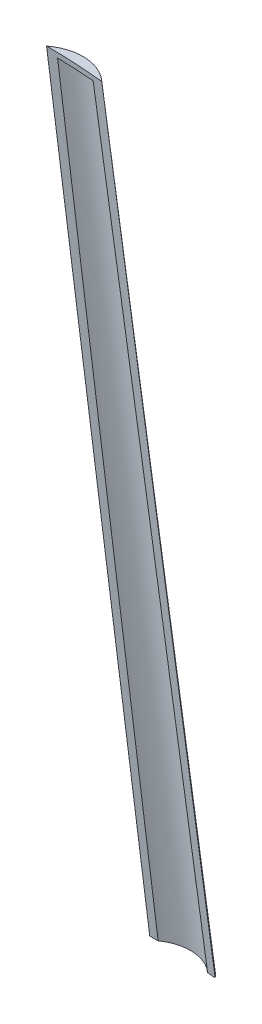
ISO-10303-21;
HEADER;
FILE_DESCRIPTION(('STEP AP214'),'2;1');
FILE_NAME('part.step','',(''),(''),'','','');
FILE_SCHEMA(('AUTOMOTIVE_DESIGN { 1 0 10303 214 1 1 1 1 }'));
ENDSEC;
DATA;
#1=APPLICATION_CONTEXT('core data for automotive mechanical design processes');
#2=APPLICATION_PROTOCOL_DEFINITION('international standard','automotive_design',2000,#1);
#3=PRODUCT_CONTEXT('',#1,'mechanical');
#4=PRODUCT('Part','Part','',(#3));
#5=PRODUCT_RELATED_PRODUCT_CATEGORY('part','',(#4));
#6=PRODUCT_DEFINITION_FORMATION('','',#4);
#7=PRODUCT_DEFINITION_CONTEXT('part definition',#1,'design');
#8=PRODUCT_DEFINITION('design','',#6,#7);
#9=PRODUCT_DEFINITION_SHAPE('','',#8);
#10=(LENGTH_UNIT() NAMED_UNIT(*) SI_UNIT(.MILLI.,.METRE.));
#11=(NAMED_UNIT(*) PLANE_ANGLE_UNIT() SI_UNIT($,.RADIAN.));
#12=(NAMED_UNIT(*) SI_UNIT($,.STERADIAN.) SOLID_ANGLE_UNIT());
#13=UNCERTAINTY_MEASURE_WITH_UNIT(LENGTH_MEASURE(1.E-05),#10,'distance_accuracy_value','');
#14=(GEOMETRIC_REPRESENTATION_CONTEXT(3) GLOBAL_UNCERTAINTY_ASSIGNED_CONTEXT((#13)) GLOBAL_UNIT_ASSIGNED_CONTEXT((#10,
#11,#12)) REPRESENTATION_CONTEXT('',''));
#15=CARTESIAN_POINT('',(0.,0.,0.));
#16=DIRECTION('',(0.,0.,1.));
#17=DIRECTION('',(1.,0.,0.));
#18=AXIS2_PLACEMENT_3D('',#15,#16,#17);
#19=CARTESIAN_POINT('',(0.76133051889543,0.,-14.5209674334158));
#20=DIRECTION('',(0.,-1.,0.));
#21=DIRECTION('',(0.,0.,-1.));
#22=AXIS2_PLACEMENT_3D('',#19,#20,#21);
#23=PLANE('',#22);
#24=CARTESIAN_POINT('',(0.,0.,-30.5943));
#25=CARTESIAN_POINT('',(1.06887805700608,0.,-30.5943));
#26=CARTESIAN_POINT('',(2.13629002850304,0.,-30.5383358699335));
#27=CARTESIAN_POINT('',(3.19930776527227,0.,-30.426561131897));
#28=(BOUNDED_CURVE() B_SPLINE_CURVE(3,(#24,#25,#26,#27),.UNSPECIFIED.,.F.,
.F.) B_SPLINE_CURVE_WITH_KNOTS((4,4),(0.,1.),
.UNSPECIFIED.) CURVE() GEOMETRIC_REPRESENTATION_ITEM() RATIONAL_B_SPLINE_CURVE((1.,
0.999085592287149,0.999085592287149,1.)) REPRESENTATION_ITEM(''));
#29=CARTESIAN_POINT('',(2.80992546783,0.,-30.4649882874627));
#30=VERTEX_POINT('',#29);
#31=CARTESIAN_POINT('',(3.19930776527228,0.,-30.4265611318971));
#32=VERTEX_POINT('',#31);
#33=EDGE_CURVE('E99',#30,#32,#28,.T.);
#34=ORIENTED_EDGE('',*,*,#33,.F.);
#35=CARTESIAN_POINT('',(3.3327978530421,0.,-29.8644789782904));
#36=CARTESIAN_POINT('',(3.31587093733269,0.,-29.884973159227));
#37=CARTESIAN_POINT('',(3.29894406031913,0.,-29.9054673722178));
#38=CARTESIAN_POINT('',(3.26508934575501,0.,-29.9464569546518));
#39=CARTESIAN_POINT('',(3.24816150820428,0.,-29.9669523240948));
#40=CARTESIAN_POINT('',(3.21414578045633,0.,-30.0081366749482));
#41=CARTESIAN_POINT('',(3.1970578894634,0.,-30.0288256556995));
#42=CARTESIAN_POINT('',(3.16288340367779,0.,-30.070202707932));
#43=CARTESIAN_POINT('',(3.14579680886669,0.,-30.090890779398));
#44=CARTESIAN_POINT('',(3.11156013911498,0.,-30.1323412720899));
#45=CARTESIAN_POINT('',(3.09441005968873,0.,-30.1531036896004));
#46=CARTESIAN_POINT('',(3.06011156149743,0.,-30.1946358906715));
#47=CARTESIAN_POINT('',(3.04296314352025,0.,-30.2154056748846));
#48=CARTESIAN_POINT('',(3.02147197041476,0.,-30.2414133637249));
#49=CARTESIAN_POINT('',(3.0171372570498,0.,-30.2466579290827));
#50=CARTESIAN_POINT('',(3.00847754806084,0.,-30.2571550876282));
#51=CARTESIAN_POINT('',(3.00415255241369,0.,-30.2624076807968));
#52=CARTESIAN_POINT('',(2.99109527831137,0.,-30.2780957747763));
#53=CARTESIAN_POINT('',(2.98227995460245,0.,-30.2884625410582));
#54=CARTESIAN_POINT('',(2.96442686903588,0.,-30.308996212316));
#55=CARTESIAN_POINT('',(2.95538918605653,0.,-30.3191631859272));
#56=CARTESIAN_POINT('',(2.93709738231753,0.,-30.3393018485029));
#57=CARTESIAN_POINT('',(2.92784324259572,0.,-30.3492735202168));
#58=CARTESIAN_POINT('',(2.899857886978,0.,-30.3787914280974));
#59=CARTESIAN_POINT('',(2.8808143286612,0.,-30.39804326987));
#60=CARTESIAN_POINT('',(2.84193146616732,0.,-30.4357387838389));
#61=CARTESIAN_POINT('',(2.82209187019717,0.,-30.4541821544041));
#62=CARTESIAN_POINT('',(2.7816939903052,0.,-30.4901968242085));
#63=CARTESIAN_POINT('',(2.76113694195525,0.,-30.507769507728));
#64=CARTESIAN_POINT('',(2.71931510794061,0.,-30.5420411164139));
#65=CARTESIAN_POINT('',(2.69805044322835,0.,-30.5587401896636));
#66=CARTESIAN_POINT('',(2.63322960295293,0.,-30.6074885919704));
#67=CARTESIAN_POINT('',(2.5886464577421,0.,-30.6381892137297));
#68=CARTESIAN_POINT('',(2.4969750957223,0.,-30.695763474943));
#69=CARTESIAN_POINT('',(2.44988292603341,0.,-30.722630814705));
#70=CARTESIAN_POINT('',(2.35379787794368,0.,-30.7719829832534));
#71=CARTESIAN_POINT('',(2.30481752343949,0.,-30.7944921862603));
#72=CARTESIAN_POINT('',(2.20518335400894,0.,-30.8353188192819));
#73=CARTESIAN_POINT('',(2.15453071494275,0.,-30.8536391257721));
#74=CARTESIAN_POINT('',(2.06438302427737,0.,-30.8821313936388));
#75=CARTESIAN_POINT('',(2.02516940271856,0.,-30.893201509416));
#76=CARTESIAN_POINT('',(1.94613397556812,0.,-30.9128891329362));
#77=CARTESIAN_POINT('',(1.90631216058741,0.,-30.9215066027757));
#78=CARTESIAN_POINT('',(1.78595293714262,0.,-30.9436232366339));
#79=CARTESIAN_POINT('',(1.70468647623695,0.,-30.9533344229304));
#80=CARTESIAN_POINT('',(1.51521483085899,0.,-30.9632699432942));
#81=CARTESIAN_POINT('',(1.40676974478397,0.,-30.9594274542786));
#82=CARTESIAN_POINT('',(1.24600797986968,0.,-30.9404546198781));
#83=CARTESIAN_POINT('',(1.19279400518685,0.,-30.9319448843344));
#84=CARTESIAN_POINT('',(1.08723626507463,0.,-30.9105996749367));
#85=CARTESIAN_POINT('',(1.03489224589884,0.,-30.8977654865168));
#86=CARTESIAN_POINT('',(0.931560599149473,0.,-30.8677977282264));
#87=CARTESIAN_POINT('',(0.880570496145942,0.,-30.8506727024616));
#88=CARTESIAN_POINT('',(0.780255955204153,0.,-30.8120357825353));
#89=CARTESIAN_POINT('',(0.730932227063242,0.,-30.7905220457792));
#90=CARTESIAN_POINT('',(0.633853148614454,0.,-30.7432265637953));
#91=CARTESIAN_POINT('',(0.586114688650734,0.,-30.7174101021702));
#92=CARTESIAN_POINT('',(0.516299192506909,0.,-30.6757853585126));
#93=CARTESIAN_POINT('',(0.49333975243541,0.,-30.661436903772));
#94=CARTESIAN_POINT('',(0.448032814493203,0.,-30.6317932937873));
#95=CARTESIAN_POINT('',(0.425685417016851,0.,-30.6164979845547));
#96=CARTESIAN_POINT('',(0.381748682614885,0.,-30.5850625288959));
#97=CARTESIAN_POINT('',(0.360156338137945,0.,-30.5689265805033));
#98=CARTESIAN_POINT('',(0.317669715396172,0.,-30.5357737750818));
#99=CARTESIAN_POINT('',(0.296775191867672,0.,-30.518757233033));
#100=CARTESIAN_POINT('',(0.265969374607726,0.,-30.4925718102718));
#101=CARTESIAN_POINT('',(0.255782059968229,0.,-30.4837257979953));
#102=CARTESIAN_POINT('',(0.235600367159372,0.,-30.4658180711845));
#103=CARTESIAN_POINT('',(0.225605971085147,0.,-30.4567563768437));
#104=CARTESIAN_POINT('',(0.205805096256007,0.,-30.4384227655323));
#105=CARTESIAN_POINT('',(0.195998682930859,0.,-30.4291507777328));
#106=CARTESIAN_POINT('',(0.181458514654617,0.,-30.4150676177668));
#107=CARTESIAN_POINT('',(0.17663981910375,0.,-30.4103438164763));
#108=CARTESIAN_POINT('',(0.167003701387095,0.,-30.4008948956207));
#109=CARTESIAN_POINT('',(0.162186279237216,0.,-30.3961697760407));
#110=CARTESIAN_POINT('',(0.138038011659272,0.,-30.3724849109735));
#111=CARTESIAN_POINT('',(0.118706044940013,0.,-30.3535262283994));
#112=CARTESIAN_POINT('',(0.0800458824625109,0.,-30.315611318298));
#113=CARTESIAN_POINT('',(0.0607176866000475,0.,-30.2966550908696));
#114=CARTESIAN_POINT('',(0.0220338220253833,0.,-30.258716016746));
#115=CARTESIAN_POINT('',(0.00267815307508361,0.,-30.2397331702762));
#116=CARTESIAN_POINT('',(-0.0360339731241707,0.,-30.2017666112223));
#117=CARTESIAN_POINT('',(-0.0553904303710466,0.,-30.1827828986361));
#118=CARTESIAN_POINT('',(-0.112385725788332,0.,-30.1268851687917));
#119=CARTESIAN_POINT('',(-0.150024571427211,0.,-30.0899711583127));
#120=CARTESIAN_POINT('',(-0.225225465375784,0.,-30.016218416562));
#121=CARTESIAN_POINT('',(-0.262787513726055,0.,-29.9793796853305));
#122=CARTESIAN_POINT('',(-0.337755342677714,0.,-29.905855462761));
#123=CARTESIAN_POINT('',(-0.375161123317617,0.,-29.8691699714628));
#124=CARTESIAN_POINT('',(-0.449736933801315,0.,-29.7960301774817));
#125=CARTESIAN_POINT('',(-0.486906963716127,0.,-29.759575874871));
#126=CARTESIAN_POINT('',(-0.524076987017852,0.,-29.7231215655915));
#127=B_SPLINE_CURVE_WITH_KNOTS('',3,(#35,#36,#37,#38,#39,#40,#41,#42,#43,#44,#45,#46,#47,#48,
#49,#50,#51,#52,#53,#54,#55,#56,#57,#58,#59,#60,#61,#62,#63,#64,#65,#66,#67,#68,#69,#70,#71,#72,
#73,#74,#75,#76,#77,#78,#79,#80,#81,#82,#83,#84,#85,#86,#87,#88,#89,#90,#91,#92,#93,#94,#95,#96,
#97,#98,#99,#100,#101,#102,#103,#104,#105,#106,#107,#108,#109,#110,#111,#112,#113,#114,#115,
#116,#117,#118,#119,#120,#121,#122,#123,#124,#125,#126),.UNSPECIFIED.,.F.,.F.,(4,2,2,2,2,2,2,2,
2,2,2,2,2,2,2,2,2,2,2,2,2,2,2,2,2,2,2,2,2,2,2,2,2,2,2,2,2,2,2,2,2,2,2,2,2,4),(0.,
0.0797420050684884,0.159488520122112,0.239988641533021,0.320484181678358,0.40127297842667,
0.482075615856302,0.502487798464966,0.522899932409018,0.563720552364891,0.604526894911938,
0.645336825686221,0.726548498659824,0.807790217266702,0.888898330164978,0.969992649806488,
1.13218079417716,1.29463248507069,1.45614756271946,1.61755139415177,1.73971328567204,
1.86187706499731,2.10671934766264,2.43048112219906,2.59201846014457,2.75350782377574,
2.91467814323793,3.07591626963743,3.23852461818817,3.3197280715441,3.40094476601404,
3.48178884173892,3.56260419752839,3.60307751956524,3.6435470670152,3.68403045360848,
3.70427398358297,3.72451775550618,3.80574827237933,3.88696565187243,3.96829776447552,
4.04963339162899,4.20779135544087,4.36562670141466,4.52280545079583,4.67899362482989),.UNSPECIFIED.);
#128=CARTESIAN_POINT('',(0.391265889785352,0.,-30.5917979774562));
#129=VERTEX_POINT('',#128);
#130=EDGE_CURVE('E87',#30,#129,#127,.T.);
#131=ORIENTED_EDGE('',*,*,#130,.T.);
#132=CARTESIAN_POINT('',(0.,0.,-30.5943));
#133=CARTESIAN_POINT('',(1.06887805700608,0.,-30.5943));
#134=CARTESIAN_POINT('',(2.13629002850304,0.,-30.5383358699335));
#135=CARTESIAN_POINT('',(3.19930776527227,0.,-30.426561131897));
#136=(BOUNDED_CURVE() B_SPLINE_CURVE(3,(#132,#133,#134,#135),.UNSPECIFIED.,.F.,
.F.) B_SPLINE_CURVE_WITH_KNOTS((4,4),(0.,1.),
.UNSPECIFIED.) CURVE() GEOMETRIC_REPRESENTATION_ITEM() RATIONAL_B_SPLINE_CURVE((1.,
0.999085592287149,0.999085592287149,1.)) REPRESENTATION_ITEM(''));
#137=CARTESIAN_POINT('',(0.,0.,-30.5943));
#138=VERTEX_POINT('',#137);
#139=EDGE_CURVE('E97',#138,#129,#136,.T.);
#140=ORIENTED_EDGE('',*,*,#139,.F.);
#141=CARTESIAN_POINT('',(3.19930776527228,0.,-30.4265611318971));
#142=CARTESIAN_POINT('',(3.02930759673242,0.,-30.6324146776841));
#143=CARTESIAN_POINT('',(2.80519396197718,0.,-30.824005952012));
#144=CARTESIAN_POINT('',(2.26754315239259,0.,-31.1073207120442));
#145=CARTESIAN_POINT('',(1.95461123128462,0.,-31.1967477629276));
#146=CARTESIAN_POINT('',(1.31841222879429,0.,-31.2301035099815));
#147=CARTESIAN_POINT('',(0.997844447016944,0.,-31.1738906825807));
#148=CARTESIAN_POINT('',(0.433514609850333,0.,-30.9483524792037));
#149=CARTESIAN_POINT('',(0.1905946325968,0.,-30.7812476548181));
#150=CARTESIAN_POINT('',(0.,0.,-30.5943));
#151=B_SPLINE_CURVE_WITH_KNOTS('',3,(#141,#142,#143,#144,#145,#146,#147,#148,#149,#150),
.UNSPECIFIED.,.F.,.F.,(4,2,2,2,4),(0.,0.25,0.5,0.75,1.),.UNSPECIFIED.);
#152=EDGE_CURVE('E199',#32,#138,#151,.T.);
#153=ORIENTED_EDGE('',*,*,#152,.F.);
#154=EDGE_LOOP('',(#34,#131,#140,#153));
#155=FACE_BOUND('',#154,.T.);
#156=ADVANCED_FACE('F39',(#155),#23,.T.);
#157=CARTESIAN_POINT('',(0.632974739504811,38.1,-12.072509494788));
#158=DIRECTION('',(0.,-1.,0.));
#159=DIRECTION('',(0.,0.,-1.));
#160=AXIS2_PLACEMENT_3D('',#157,#158,#159);
#161=PLANE('',#160);
#162=CARTESIAN_POINT('',(0.,38.1,-25.81275));
#163=CARTESIAN_POINT('',(0.179419108830195,38.1,-25.9489443418503));
#164=CARTESIAN_POINT('',(0.392639745748967,38.1,-26.0639687677867));
#165=CARTESIAN_POINT('',(0.86344097524147,38.1,-26.2145660525579));
#166=CARTESIAN_POINT('',(1.12050270785798,38.1,-26.2493104593813));
#167=CARTESIAN_POINT('',(1.63065439248309,38.1,-26.2225626543933));
#168=CARTESIAN_POINT('',(1.8826732794004,38.1,-26.1611265996837));
#169=CARTESIAN_POINT('',(2.33514445877658,38.1,-25.9621211432107));
#170=CARTESIAN_POINT('',(2.53516737127845,38.1,-25.8254299107035));
#171=CARTESIAN_POINT('',(2.69936025092448,38.1,-25.6712196203887));
#172=B_SPLINE_CURVE_WITH_KNOTS('',3,(#162,#163,#164,#165,#166,#167,#168,#169,#170,#171),
.UNSPECIFIED.,.F.,.F.,(4,2,2,2,4),(0.,0.25,0.5,0.75,1.),.UNSPECIFIED.);
#173=CARTESIAN_POINT('',(2.69936025092448,38.1,-25.6712196203887));
#174=VERTEX_POINT('',#173);
#175=CARTESIAN_POINT('',(0.,38.1,-25.81275));
#176=VERTEX_POINT('',#175);
#177=EDGE_CURVE('E51',#174,#176,#172,.F.);
#178=ORIENTED_EDGE('',*,*,#177,.T.);
#179=CARTESIAN_POINT('',(2.69936025092447,38.1,-25.6712196203887));
#180=CARTESIAN_POINT('',(1.80245768252741,38.1,-25.7655300262784));
#181=CARTESIAN_POINT('',(0.901847365054823,38.1,-25.81275));
#182=CARTESIAN_POINT('',(0.,38.1,-25.81275));
#183=(BOUNDED_CURVE() B_SPLINE_CURVE(3,(#179,#180,#181,#182),.UNSPECIFIED.,.F.,
.F.) B_SPLINE_CURVE_WITH_KNOTS((4,4),(0.,1.),
.UNSPECIFIED.) CURVE() GEOMETRIC_REPRESENTATION_ITEM() RATIONAL_B_SPLINE_CURVE((1.,
0.999085545492377,0.999085545492377,1.)) REPRESENTATION_ITEM(''));
#184=EDGE_CURVE('E11',#176,#174,#183,.F.);
#185=ORIENTED_EDGE('',*,*,#184,.T.);
#186=EDGE_LOOP('',(#178,#185));
#187=FACE_BOUND('',#186,.T.);
#188=ADVANCED_FACE('F41',(#187),#161,.F.);
#189=CARTESIAN_POINT('',(0.,0.,-30.5943));
#190=CARTESIAN_POINT('',(0.,38.1,-25.81275));
#191=CARTESIAN_POINT('',(1.06887805700608,0.,-30.5943));
#192=CARTESIAN_POINT('',(0.901847365054823,38.1,-25.81275));
#193=CARTESIAN_POINT('',(2.13629002850304,0.,-30.5383358699335));
#194=CARTESIAN_POINT('',(1.80245768252741,38.1,-25.7655300262784));
#195=CARTESIAN_POINT('',(3.19930776527227,0.,-30.4265611318971));
#196=CARTESIAN_POINT('',(2.69936025092447,38.1,-25.6712196203887));
#197=(BOUNDED_SURFACE() B_SPLINE_SURFACE(3,1,((#189,#190),(#191,#192),(#193,#194),(#195,#196)),
.UNSPECIFIED.,.F.,.F.,.F.) B_SPLINE_SURFACE_WITH_KNOTS((4,4),(2,2),(0.,1.),(0.,1.),
.UNSPECIFIED.) GEOMETRIC_REPRESENTATION_ITEM() RATIONAL_B_SPLINE_SURFACE(((1.,1.),
(0.999085592287149,0.999085545492377),(0.999085592287149,0.999085545492377),(1.,1.))) REPRESENTATION_ITEM('') SURFACE());
#198=CARTESIAN_POINT('',(2.80992546783002,0.,-30.4649882874627));
#199=CARTESIAN_POINT('',(2.79253103494185,1.18897437298934,-30.3167429353681));
#200=CARTESIAN_POINT('',(2.775077362372,2.37794851533735,-30.1685024990219));
#201=CARTESIAN_POINT('',(2.68746096620895,8.32281788010066,-29.4273288121191));
#202=CARTESIAN_POINT('',(2.61625415036277,13.0787085343285,-28.83448111179));
#203=CARTESIAN_POINT('',(2.50677819905721,20.2125300712102,-27.9454220562866));
#204=CARTESIAN_POINT('',(2.46984192769212,22.5904681558285,-27.6491044561417));
#205=CARTESIAN_POINT('',(2.39845531519661,27.1146764823994,-27.0854239568966));
#206=CARTESIAN_POINT('',(2.36411334914325,29.2609473693433,-26.8180525695314));
#207=CARTESIAN_POINT('',(2.294156317051,33.553480766456,-26.2834073806644));
#208=CARTESIAN_POINT('',(2.25854125086686,35.6997432766237,-26.0161335791736));
#209=CARTESIAN_POINT('',(2.22212941453792,37.846,-25.748920086756));
#210=B_SPLINE_CURVE_WITH_KNOTS('',3,(#198,#199,#200,#201,#202,#203,#204,#205,#206,#207,#208,
#209),.UNSPECIFIED.,.F.,.F.,(4,2,2,2,2,4),(0.,3.59492060794055,17.9746035710985,
25.1644449301292,31.6538444037912,38.1432446177952),.UNSPECIFIED.);
#211=CARTESIAN_POINT('',(2.22212941453792,37.846,-25.748920086756));
#212=VERTEX_POINT('',#211);
#213=EDGE_CURVE('E93',#30,#212,#210,.T.);
#214=CARTESIAN_POINT('',(3.19930776527227,0.,-30.4265611318971));
#215=CARTESIAN_POINT('',(2.69936025092447,38.1,-25.6712196203887));
#216=(BOUNDED_CURVE() B_SPLINE_CURVE(1,(#214,#215),.UNSPECIFIED.,.F.,
.F.) B_SPLINE_CURVE_WITH_KNOTS((2,2),(0.,1.),
.UNSPECIFIED.) CURVE() GEOMETRIC_REPRESENTATION_ITEM() RATIONAL_B_SPLINE_CURVE((1.,1.)) REPRESENTATION_ITEM(''));
#217=EDGE_CURVE('E198',#32,#174,#216,.T.);
#218=CARTESIAN_POINT('',(0.,38.1,-25.81275));
#219=CARTESIAN_POINT('',(0.,0.,-30.5943));
#220=(BOUNDED_CURVE() B_SPLINE_CURVE(1,(#218,#219),.UNSPECIFIED.,.F.,
.F.) B_SPLINE_CURVE_WITH_KNOTS((2,2),(0.,1.),
.UNSPECIFIED.) CURVE() GEOMETRIC_REPRESENTATION_ITEM() RATIONAL_B_SPLINE_CURVE((1.,1.)) REPRESENTATION_ITEM(''));
#221=EDGE_CURVE('E66',#176,#138,#220,.T.);
#222=CARTESIAN_POINT('',(0.378184815971581,-9.48672898656724,-31.7826345375691));
#223=CARTESIAN_POINT('',(0.3842233609056,-4.73082629735887,-31.1856535628708));
#224=CARTESIAN_POINT('',(0.390935329176055,0.0250740954229074,-30.5886591147025));
#225=CARTESIAN_POINT('',(0.402803650646837,7.15891675253198,-29.693125073477));
#226=CARTESIAN_POINT('',(0.407059819801638,9.53686320749091,-29.3946066367088));
#227=CARTESIAN_POINT('',(0.416303987152303,14.2927527143427,-28.7975519484428));
#228=CARTESIAN_POINT('',(0.421291985413859,16.6706957662353,-28.4990156969434));
#229=CARTESIAN_POINT('',(0.429483181916106,20.2376059893472,-28.0511932358924));
#230=CARTESIAN_POINT('',(0.432331780017439,21.4265751210115,-27.9019160954779));
#231=CARTESIAN_POINT('',(0.441280894612347,24.9934808086255,-27.4540740260954));
#232=CARTESIAN_POINT('',(0.44778473016059,27.3714150560991,-27.1554985244517));
#233=CARTESIAN_POINT('',(0.462221537691101,32.1272740172091,-26.5583079972853));
#234=CARTESIAN_POINT('',(0.470154509506012,34.5051987308467,-26.2596929717673));
#235=CARTESIAN_POINT('',(0.487989267781925,39.2610346874306,-25.6624049396916));
#236=CARTESIAN_POINT('',(0.497891054985691,41.6389459303715,-25.3637319331122));
#237=CARTESIAN_POINT('',(0.514900108196617,45.2057946923369,-24.9156544525775));
#238=CARTESIAN_POINT('',(0.520929189877073,46.3947415763996,-24.7662839245203));
#239=CARTESIAN_POINT('',(0.533899105162402,48.7726268056654,-24.4675128541107));
#240=CARTESIAN_POINT('',(0.540839938940949,49.9615651508667,-24.3181123117527));
#241=CARTESIAN_POINT('',(0.548333128355954,51.1504978524167,-24.1686930988624));
#242=B_SPLINE_CURVE_WITH_KNOTS('',3,(#222,#223,#224,#225,#226,#227,#228,#229,#230,#231,#232,
#233,#234,#235,#236,#237,#238,#239,#240,#241),.UNSPECIFIED.,.F.,.F.,(4,2,2,2,2,2,2,2,2,4),(0.,
14.3796837263891,21.5695269477643,28.7593708145504,32.3542914362089,39.5441344969765,
46.73397671578,53.9238216470573,57.5187460104273,61.1136710585685),.UNSPECIFIED.);
#243=CARTESIAN_POINT('',(0.482739214670025,37.846,-25.8401181812264));
#244=VERTEX_POINT('',#243);
#245=EDGE_CURVE('E84',#244,#129,#242,.F.);
#246=CARTESIAN_POINT('',(0.482739214670027,37.846,-25.8401181812264));
#247=CARTESIAN_POINT('',(0.772984845141501,37.846,-25.8346931040966));
#248=CARTESIAN_POINT('',(1.06297464773808,37.846,-25.8243878154529));
#249=CARTESIAN_POINT('',(1.64277196300159,37.846,-25.7939995524582));
#250=CARTESIAN_POINT('',(1.93257889369431,37.846,-25.7739054762785));
#251=CARTESIAN_POINT('',(2.22212941453792,37.846,-25.7489200867561));
#252=B_SPLINE_CURVE_WITH_KNOTS('',3,(#246,#247,#248,#249,#250,#251),.UNSPECIFIED.,.F.,.F.,(4,2,
4),(0.,0.870518558823587,1.7420267118408),.UNSPECIFIED.);
#253=EDGE_CURVE('E205',#244,#212,#252,.T.);
#254=ORIENTED_EDGE('',*,*,#213,.F.);
#255=ORIENTED_EDGE('',*,*,#33,.T.);
#256=ORIENTED_EDGE('',*,*,#217,.T.);
#257=ORIENTED_EDGE('',*,*,#184,.F.);
#258=ORIENTED_EDGE('',*,*,#221,.T.);
#259=ORIENTED_EDGE('',*,*,#139,.T.);
#260=ORIENTED_EDGE('',*,*,#245,.F.);
#261=ORIENTED_EDGE('',*,*,#253,.T.);
#262=EDGE_LOOP('',(#254,#255,#256,#257,#258,#259,#260,#261));
#263=FACE_BOUND('',#262,.T.);
#264=ADVANCED_FACE('F103',(#263),#197,.T.);
#265=CARTESIAN_POINT('',(3.19930776527228,0.,-30.4265611318971));
#266=CARTESIAN_POINT('',(2.69936025092448,38.1,-25.6712196203887));
#267=CARTESIAN_POINT('',(3.02930759673242,0.,-30.6324146776841));
#268=CARTESIAN_POINT('',(2.53516737127845,38.1,-25.8254299107035));
#269=CARTESIAN_POINT('',(2.80519396197718,0.,-30.824005952012));
#270=CARTESIAN_POINT('',(2.33514445877658,38.1,-25.9621211432107));
#271=CARTESIAN_POINT('',(2.26754315239259,0.,-31.1073207120442));
#272=CARTESIAN_POINT('',(1.8826732794004,38.1,-26.1611265996837));
#273=CARTESIAN_POINT('',(1.95461123128462,0.,-31.1967477629276));
#274=CARTESIAN_POINT('',(1.63065439248309,38.1,-26.2225626543933));
#275=CARTESIAN_POINT('',(1.31841222879429,0.,-31.2301035099815));
#276=CARTESIAN_POINT('',(1.12050270785798,38.1,-26.2493104593813));
#277=CARTESIAN_POINT('',(0.997844447016944,0.,-31.1738906825807));
#278=CARTESIAN_POINT('',(0.86344097524147,38.1,-26.2145660525579));
#279=CARTESIAN_POINT('',(0.433514609850333,0.,-30.9483524792037));
#280=CARTESIAN_POINT('',(0.392639745748967,38.1,-26.0639687677867));
#281=CARTESIAN_POINT('',(0.1905946325968,0.,-30.7812476548181));
#282=CARTESIAN_POINT('',(0.179419108830195,38.1,-25.9489443418503));
#283=CARTESIAN_POINT('',(0.,0.,-30.5943));
#284=CARTESIAN_POINT('',(0.,38.1,-25.81275));
#285=B_SPLINE_SURFACE_WITH_KNOTS('',3,1,((#265,#266),(#267,#268),(#269,#270),(#271,#272),(#273,
#274),(#275,#276),(#277,#278),(#279,#280),(#281,#282),(#283,#284)),.UNSPECIFIED.,.F.,.F.,.F.,(4,
2,2,2,4),(2,2),(0.,0.25,0.5,0.75,1.),(0.,1.),.UNSPECIFIED.);
#286=ORIENTED_EDGE('',*,*,#152,.T.);
#287=ORIENTED_EDGE('',*,*,#221,.F.);
#288=ORIENTED_EDGE('',*,*,#177,.F.);
#289=ORIENTED_EDGE('',*,*,#217,.F.);
#290=EDGE_LOOP('',(#286,#287,#288,#289));
#291=FACE_BOUND('',#290,.T.);
#292=ADVANCED_FACE('F128',(#291),#285,.T.);
#293=CARTESIAN_POINT('',(0.632974739504811,37.846,-12.072509494788));
#294=DIRECTION('',(0.,-1.,0.));
#295=DIRECTION('',(0.,0.,-1.));
#296=AXIS2_PLACEMENT_3D('',#293,#294,#295);
#297=PLANE('',#296);
#298=CARTESIAN_POINT('',(2.22212941453792,37.846,-25.748920086756));
#299=CARTESIAN_POINT('',(2.17792732544404,37.846,-25.7757712382283));
#300=CARTESIAN_POINT('',(2.13258905551269,37.846,-25.8007585992188));
#301=CARTESIAN_POINT('',(2.03997652831125,37.846,-25.8467857494694));
#302=CARTESIAN_POINT('',(1.99270312221994,37.846,-25.8678272520796));
#303=CARTESIAN_POINT('',(1.89658890905924,37.846,-25.9057383329415));
#304=CARTESIAN_POINT('',(1.84775052746445,37.846,-25.9226140447833));
#305=CARTESIAN_POINT('',(1.74884470947575,37.846,-25.9522826922667));
#306=CARTESIAN_POINT('',(1.69877659843006,37.846,-25.9650733303345));
#307=CARTESIAN_POINT('',(1.54716331316548,37.846,-25.9971857574193));
#308=CARTESIAN_POINT('',(1.4441708656964,37.846,-26.0102630663192));
#309=CARTESIAN_POINT('',(1.28930837280419,37.846,-26.0164130981953));
#310=CARTESIAN_POINT('',(1.2376087278469,37.846,-26.0162165792151));
#311=CARTESIAN_POINT('',(1.13440306244422,37.846,-26.0115172712831));
#312=CARTESIAN_POINT('',(1.08289707159967,37.846,-26.0070138488839));
#313=CARTESIAN_POINT('',(0.93679471786359,37.846,-25.9881543987009));
#314=CARTESIAN_POINT('',(0.842780159309678,37.846,-25.9686775993076));
#315=CARTESIAN_POINT('',(0.705031796205487,37.846,-25.9285131665864));
#316=CARTESIAN_POINT('',(0.659630965260347,37.846,-25.9132858102678));
#317=CARTESIAN_POINT('',(0.57014059672953,37.846,-25.8793090197661));
#318=CARTESIAN_POINT('',(0.526051715169844,37.846,-25.8605578567177));
#319=CARTESIAN_POINT('',(0.482739214670045,37.846,-25.8401181812264));
#320=B_SPLINE_CURVE_WITH_KNOTS('',3,(#298,#299,#300,#301,#302,#303,#304,#305,#306,#307,#308,
#309,#310,#311,#312,#313,#314,#315,#316,#317,#318,#319),.UNSPECIFIED.,.F.,.F.,(4,2,2,2,2,2,2,2,
2,2,4),(0.,0.155114887463636,0.310162264996787,0.464979975037645,0.619884606703943,
0.92957177714286,1.08451399902202,1.23947901287387,1.52614875246726,1.66968245963853,
1.813286772665),.UNSPECIFIED.);
#321=EDGE_CURVE('E58',#212,#244,#320,.T.);
#322=ORIENTED_EDGE('',*,*,#321,.F.);
#323=ORIENTED_EDGE('',*,*,#253,.F.);
#324=EDGE_LOOP('',(#322,#323));
#325=FACE_BOUND('',#324,.T.);
#326=ADVANCED_FACE('F174',(#325),#297,.T.);
#327=CARTESIAN_POINT('',(3.19930776527228,0.,-30.4265611318971));
#328=CARTESIAN_POINT('',(2.69936025092448,38.1,-25.6712196203887));
#329=CARTESIAN_POINT('',(3.02930759673242,0.,-30.6324146776841));
#330=CARTESIAN_POINT('',(2.53516737127845,38.1,-25.8254299107035));
#331=CARTESIAN_POINT('',(2.80519396197718,0.,-30.824005952012));
#332=CARTESIAN_POINT('',(2.33514445877658,38.1,-25.9621211432107));
#333=CARTESIAN_POINT('',(2.26754315239259,0.,-31.1073207120442));
#334=CARTESIAN_POINT('',(1.8826732794004,38.1,-26.1611265996837));
#335=CARTESIAN_POINT('',(1.95461123128462,0.,-31.1967477629276));
#336=CARTESIAN_POINT('',(1.63065439248309,38.1,-26.2225626543933));
#337=CARTESIAN_POINT('',(1.31841222879429,0.,-31.2301035099815));
#338=CARTESIAN_POINT('',(1.12050270785798,38.1,-26.2493104593813));
#339=CARTESIAN_POINT('',(0.997844447016944,0.,-31.1738906825807));
#340=CARTESIAN_POINT('',(0.86344097524147,38.1,-26.2145660525579));
#341=CARTESIAN_POINT('',(0.433514609850333,0.,-30.9483524792037));
#342=CARTESIAN_POINT('',(0.392639745748967,38.1,-26.0639687677867));
#343=CARTESIAN_POINT('',(0.1905946325968,0.,-30.7812476548181));
#344=CARTESIAN_POINT('',(0.179419108830195,38.1,-25.9489443418503));
#345=CARTESIAN_POINT('',(0.,0.,-30.5943));
#346=CARTESIAN_POINT('',(0.,38.1,-25.81275));
#347=B_SPLINE_SURFACE_WITH_KNOTS('',3,1,((#327,#328),(#329,#330),(#331,#332),(#333,#334),(#335,
#336),(#337,#338),(#339,#340),(#341,#342),(#343,#344),(#345,#346)),.UNSPECIFIED.,.F.,.F.,.F.,(4,
2,2,2,4),(2,2),(0.,0.25,0.5,0.75,1.),(0.,1.),.UNSPECIFIED.);
#348=OFFSET_SURFACE('',#347,-0.254,.F.);
#349=ORIENTED_EDGE('',*,*,#130,.F.);
#350=ORIENTED_EDGE('',*,*,#213,.T.);
#351=ORIENTED_EDGE('',*,*,#321,.T.);
#352=ORIENTED_EDGE('',*,*,#245,.T.);
#353=EDGE_LOOP('',(#349,#350,#351,#352));
#354=FACE_BOUND('',#353,.T.);
#355=ADVANCED_FACE('F86',(#354),#348,.F.);
#356=CLOSED_SHELL('',(#156,#188,#264,#292,#326,#355));
#357=MANIFOLD_SOLID_BREP('B2',#356);
#358=ADVANCED_BREP_SHAPE_REPRESENTATION('',(#18,#357),#14);
#359=SHAPE_DEFINITION_REPRESENTATION(#9,#358);
ENDSEC;
END-ISO-10303-21;
